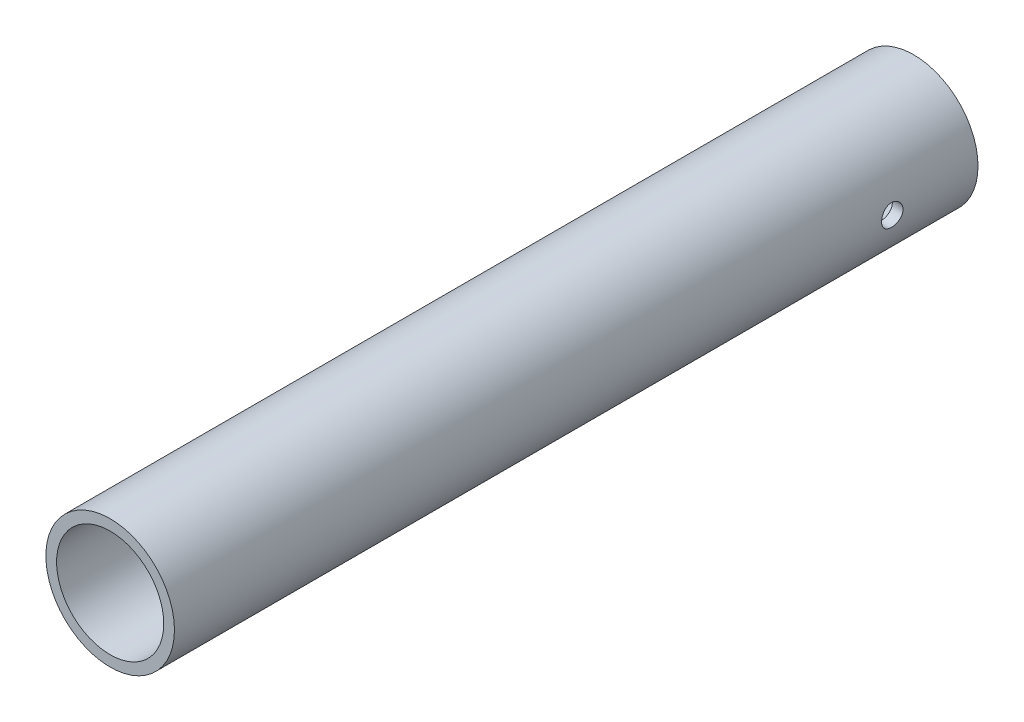
ISO-10303-21;
HEADER;
FILE_DESCRIPTION(('STEP AP214'),'2;1');
FILE_NAME('part.step','',(''),(''),'','','');
FILE_SCHEMA(('AUTOMOTIVE_DESIGN { 1 0 10303 214 1 1 1 1 }'));
ENDSEC;
DATA;
#1=APPLICATION_CONTEXT('core data for automotive mechanical design processes');
#2=APPLICATION_PROTOCOL_DEFINITION('international standard','automotive_design',2000,#1);
#3=PRODUCT_CONTEXT('',#1,'mechanical');
#4=PRODUCT('Part','Part','',(#3));
#5=PRODUCT_RELATED_PRODUCT_CATEGORY('part','',(#4));
#6=PRODUCT_DEFINITION_FORMATION('','',#4);
#7=PRODUCT_DEFINITION_CONTEXT('part definition',#1,'design');
#8=PRODUCT_DEFINITION('design','',#6,#7);
#9=PRODUCT_DEFINITION_SHAPE('','',#8);
#10=(LENGTH_UNIT() NAMED_UNIT(*) SI_UNIT(.MILLI.,.METRE.));
#11=(NAMED_UNIT(*) PLANE_ANGLE_UNIT() SI_UNIT($,.RADIAN.));
#12=(NAMED_UNIT(*) SI_UNIT($,.STERADIAN.) SOLID_ANGLE_UNIT());
#13=UNCERTAINTY_MEASURE_WITH_UNIT(LENGTH_MEASURE(1.E-05),#10,'distance_accuracy_value','');
#14=(GEOMETRIC_REPRESENTATION_CONTEXT(3) GLOBAL_UNCERTAINTY_ASSIGNED_CONTEXT((#13)) GLOBAL_UNIT_ASSIGNED_CONTEXT((#10,
#11,#12)) REPRESENTATION_CONTEXT('',''));
#15=CARTESIAN_POINT('',(0.,0.,0.));
#16=DIRECTION('',(0.,0.,1.));
#17=DIRECTION('',(1.,0.,0.));
#18=AXIS2_PLACEMENT_3D('',#15,#16,#17);
#19=CARTESIAN_POINT('',(0.,0.,75.));
#20=DIRECTION('',(0.,0.,1.));
#21=DIRECTION('',(1.,0.,0.));
#22=AXIS2_PLACEMENT_3D('',#19,#20,#21);
#23=PLANE('',#22);
#24=CARTESIAN_POINT('',(0.,0.,75.));
#25=DIRECTION('',(0.,0.,1.));
#26=DIRECTION('',(1.,0.,0.));
#27=AXIS2_PLACEMENT_3D('',#24,#25,#26);
#28=CIRCLE('',#27,6.);
#29=CARTESIAN_POINT('',(6.,0.,75.));
#30=VERTEX_POINT('',#29);
#31=EDGE_CURVE('E10',#30,#30,#28,.T.);
#32=ORIENTED_EDGE('',*,*,#31,.T.);
#33=EDGE_LOOP('',(#32));
#34=FACE_BOUND('',#33,.T.);
#35=CARTESIAN_POINT('',(0.,0.,75.));
#36=DIRECTION('',(0.,0.,1.));
#37=DIRECTION('',(1.,0.,0.));
#38=AXIS2_PLACEMENT_3D('',#35,#36,#37);
#39=CIRCLE('',#38,5.);
#40=CARTESIAN_POINT('',(5.,0.,75.));
#41=VERTEX_POINT('',#40);
#42=EDGE_CURVE('E49',#41,#41,#39,.T.);
#43=ORIENTED_EDGE('',*,*,#42,.F.);
#44=EDGE_LOOP('',(#43));
#45=FACE_BOUND('',#44,.T.);
#46=ADVANCED_FACE('F30',(#34,#45),#23,.T.);
#47=CARTESIAN_POINT('',(0.,0.,0.));
#48=DIRECTION('',(0.,0.,1.));
#49=DIRECTION('',(1.,0.,0.));
#50=AXIS2_PLACEMENT_3D('',#47,#48,#49);
#51=PLANE('',#50);
#52=CARTESIAN_POINT('',(0.,0.,0.));
#53=DIRECTION('',(0.,0.,1.));
#54=DIRECTION('',(1.,0.,0.));
#55=AXIS2_PLACEMENT_3D('',#52,#53,#54);
#56=CIRCLE('',#55,6.);
#57=CARTESIAN_POINT('',(6.,0.,0.));
#58=VERTEX_POINT('',#57);
#59=EDGE_CURVE('E44',#58,#58,#56,.T.);
#60=ORIENTED_EDGE('',*,*,#59,.F.);
#61=EDGE_LOOP('',(#60));
#62=FACE_BOUND('',#61,.T.);
#63=CARTESIAN_POINT('',(0.,0.,0.));
#64=DIRECTION('',(0.,0.,1.));
#65=DIRECTION('',(1.,0.,0.));
#66=AXIS2_PLACEMENT_3D('',#63,#64,#65);
#67=CIRCLE('',#66,5.);
#68=CARTESIAN_POINT('',(5.,0.,0.));
#69=VERTEX_POINT('',#68);
#70=EDGE_CURVE('E52',#69,#69,#67,.T.);
#71=ORIENTED_EDGE('',*,*,#70,.T.);
#72=EDGE_LOOP('',(#71));
#73=FACE_BOUND('',#72,.T.);
#74=ADVANCED_FACE('F88',(#62,#73),#51,.F.);
#75=CARTESIAN_POINT('',(0.,0.,75.));
#76=DIRECTION('',(0.,0.,-1.));
#77=DIRECTION('',(-1.,0.,0.));
#78=AXIS2_PLACEMENT_3D('',#75,#76,#77);
#79=CYLINDRICAL_SURFACE('',#78,6.);
#80=CARTESIAN_POINT('',(-6.,0.,7.));
#81=CARTESIAN_POINT('',(-5.9999990446753,0.0557563619832858,7.00000223557913));
#82=CARTESIAN_POINT('',(-5.99921471165214,0.111543152735528,7.00467890998757));
#83=CARTESIAN_POINT('',(-5.99616137976555,0.221552088669217,7.02325426350613));
#84=CARTESIAN_POINT('',(-5.99389101569556,0.275772747183698,7.03716142276464));
#85=CARTESIAN_POINT('',(-5.9881202729458,0.381041898885057,7.0737661794371));
#86=CARTESIAN_POINT('',(-5.98462090063677,0.43209294737276,7.09645658625623));
#87=CARTESIAN_POINT('',(-5.97677690832828,0.529656736791177,7.14996491682096));
#88=CARTESIAN_POINT('',(-5.97243238501774,0.576169995951435,7.1807819109932));
#89=CARTESIAN_POINT('',(-5.96333326983325,0.663789045716671,7.24998203352818));
#90=CARTESIAN_POINT('',(-5.95857548725943,0.704845161413986,7.28842764585445));
#91=CARTESIAN_POINT('',(-5.94921050750693,0.77995539946397,7.37165918738913));
#92=CARTESIAN_POINT('',(-5.94460331985067,0.814009079756388,7.41644551658265));
#93=CARTESIAN_POINT('',(-5.93603026303912,0.874346850242052,7.51142838647882));
#94=CARTESIAN_POINT('',(-5.93206851636655,0.900581821144399,7.5616565347219));
#95=CARTESIAN_POINT('',(-5.9252791591787,0.944223346164486,7.66588382572025));
#96=CARTESIAN_POINT('',(-5.92245147205723,0.961630496626244,7.71988271347105));
#97=CARTESIAN_POINT('',(-5.91828214737102,0.986965751113922,7.82959210994262));
#98=CARTESIAN_POINT('',(-5.9169270739428,0.994979611654159,7.88528229460056));
#99=CARTESIAN_POINT('',(-5.9158157557466,1.00156669011595,7.99723211075339));
#100=CARTESIAN_POINT('',(-5.91605939782886,1.0001405761556,8.05349170166692));
#101=CARTESIAN_POINT('',(-5.91810571545422,0.987958039358459,8.16437114451018));
#102=CARTESIAN_POINT('',(-5.91989229327567,0.977297952755908,8.21900192141809));
#103=CARTESIAN_POINT('',(-5.92479798084403,0.947101256161377,8.32568852713165));
#104=CARTESIAN_POINT('',(-5.92791713629309,0.927564341727895,8.37774426755542));
#105=CARTESIAN_POINT('',(-5.9351539173364,0.880070898437564,8.47809152937637));
#106=CARTESIAN_POINT('',(-5.9392762684293,0.852074365551885,8.52636376243249));
#107=CARTESIAN_POINT('',(-5.94805167366004,0.788484807022972,8.61756176021535));
#108=CARTESIAN_POINT('',(-5.95270477061715,0.752891168261714,8.66048709298197));
#109=CARTESIAN_POINT('',(-5.96208811151914,0.67459288486362,8.74033043432294));
#110=CARTESIAN_POINT('',(-5.96681859692661,0.63180558554925,8.77716740741603));
#111=CARTESIAN_POINT('',(-5.97577040558689,0.540614099592658,8.84315110506613));
#112=CARTESIAN_POINT('',(-5.97999172555898,0.492209876762568,8.87229778007329));
#113=CARTESIAN_POINT('',(-5.98745557157165,0.391082366466684,8.92208089085451));
#114=CARTESIAN_POINT('',(-5.99069727362979,0.338355490225864,8.9427101677325));
#115=CARTESIAN_POINT('',(-5.99583001205064,0.230119338241092,8.97479768609839));
#116=CARTESIAN_POINT('',(-5.9977211614019,0.174610295671787,8.98625669478949));
#117=CARTESIAN_POINT('',(-5.99992451937074,0.0630839605206491,8.99956854338445));
#118=CARTESIAN_POINT('',(-6.00025501205114,0.00708029486040419,9.00153262872224));
#119=CARTESIAN_POINT('',(-5.99934989768468,-0.104455909155955,8.99609546222875));
#120=CARTESIAN_POINT('',(-5.99811435089647,-0.159988465556816,8.9886945707465));
#121=CARTESIAN_POINT('',(-5.99422730775281,-0.268662470218706,8.96483006026581));
#122=CARTESIAN_POINT('',(-5.99158441920524,-0.321816347354152,8.94842151664395));
#123=CARTESIAN_POINT('',(-5.98517785782144,-0.424618753944177,8.90706619272019));
#124=CARTESIAN_POINT('',(-5.98141412204808,-0.474267086363887,8.88211893294589));
#125=CARTESIAN_POINT('',(-5.97313806520963,-0.569132275787583,8.82413955012128));
#126=CARTESIAN_POINT('',(-5.96861942354809,-0.614306100374859,8.7910379375331));
#127=CARTESIAN_POINT('',(-5.9593538695676,-0.698497434201075,8.71778507384598));
#128=CARTESIAN_POINT('',(-5.95460694068619,-0.737514495878632,8.67763331068933));
#129=CARTESIAN_POINT('',(-5.94536070094338,-0.808697111863199,8.59092098077143));
#130=CARTESIAN_POINT('',(-5.94086446454842,-0.840787504445485,8.54429833379424));
#131=CARTESIAN_POINT('',(-5.93268611911154,-0.896680924117993,8.44625881234458));
#132=CARTESIAN_POINT('',(-5.92900398426408,-0.920484213907928,8.394842089909));
#133=CARTESIAN_POINT('',(-5.92289381479082,-0.959015332589259,8.28888410687515));
#134=CARTESIAN_POINT('',(-5.92046061724426,-0.973780573019177,8.2343567619878));
#135=CARTESIAN_POINT('',(-5.91711086734104,-0.99393418151131,8.1235519483113));
#136=CARTESIAN_POINT('',(-5.91619418313089,-0.999323364778466,8.06727463210718));
#137=CARTESIAN_POINT('',(-5.91598693233605,-1.00054914641894,7.95531793361504));
#138=CARTESIAN_POINT('',(-5.9166762260226,-0.996504054450073,7.89963984856989));
#139=CARTESIAN_POINT('',(-5.91955912581491,-0.979231935582738,7.78976830077969));
#140=CARTESIAN_POINT('',(-5.92175272704486,-0.966004938444989,7.73557483322325));
#141=CARTESIAN_POINT('',(-5.92738942512688,-0.930789795837959,7.63025662508295));
#142=CARTESIAN_POINT('',(-5.93083106887868,-0.908811836240175,7.57912839597759));
#143=CARTESIAN_POINT('',(-5.93857747568883,-0.856730801566362,7.48126573232206));
#144=CARTESIAN_POINT('',(-5.9428822815536,-0.826627323499424,7.43453151585115));
#145=CARTESIAN_POINT('',(-5.95193381618249,-0.758727553748861,7.3461857667569));
#146=CARTESIAN_POINT('',(-5.95668518230521,-0.720844225437458,7.30464159331989));
#147=CARTESIAN_POINT('',(-5.96605748944336,-0.63864361255209,7.22845935821003));
#148=CARTESIAN_POINT('',(-5.97067840010619,-0.594324845165053,7.19382289254473));
#149=CARTESIAN_POINT('',(-5.97930611856888,-0.500147667856111,7.13222069272002));
#150=CARTESIAN_POINT('',(-5.98330846501242,-0.450253115013125,7.10530958427482));
#151=CARTESIAN_POINT('',(-5.9902046704071,-0.346605227751591,7.06029220615603));
#152=CARTESIAN_POINT('',(-5.99309963270993,-0.292855797932002,7.04217716756812));
#153=CARTESIAN_POINT('',(-5.99682316333182,-0.199081324018159,7.01919789034933));
#154=CARTESIAN_POINT('',(-5.99800810909344,-0.159623532119378,7.01201021215362));
#155=CARTESIAN_POINT('',(-5.99959686394448,-0.0801157241279229,7.0024105048621));
#156=CARTESIAN_POINT('',(-6.00000068648257,-0.0400657182433973,6.99999839354506));
#157=CARTESIAN_POINT('',(-6.,0.,7.));
#158=B_SPLINE_CURVE_WITH_KNOTS('',3,(#80,#81,#82,#83,#84,#85,#86,#87,#88,#89,#90,#91,#92,#93,
#94,#95,#96,#97,#98,#99,#100,#101,#102,#103,#104,#105,#106,#107,#108,#109,#110,#111,#112,#113,
#114,#115,#116,#117,#118,#119,#120,#121,#122,#123,#124,#125,#126,#127,#128,#129,#130,#131,#132,
#133,#134,#135,#136,#137,#138,#139,#140,#141,#142,#143,#144,#145,#146,#147,#148,#149,#150,#151,
#152,#153,#154,#155,#156,#157),.UNSPECIFIED.,.T.,.F.,(4,2,2,2,2,2,2,2,2,2,2,2,2,2,2,2,2,2,2,2,2,
2,2,2,2,2,2,2,2,2,2,2,2,2,2,2,2,2,4),(0.,0.167122633975403,0.334399018278168,0.501538746810107,
0.668659365069915,0.837209964249328,1.00577120067943,1.17537008329536,1.34495750750472,
1.51298430841369,1.68099921728354,1.84728208704163,2.01357066010152,2.18065822653023,
2.34775928272229,2.5169310796453,2.68610396654339,2.85541875566361,3.02471937808459,
3.19203153396558,3.35933725214343,3.52563122802566,3.69193454330426,3.85970730250809,
4.02749225221713,4.19701528803047,4.36653294950377,4.53534408936708,4.70414055114646,
4.87083163809079,5.03752218475253,5.20401927290488,5.37052462011734,5.53900553677356,
5.70752533551588,5.87720892642879,6.04672300852028,6.16681699265607,6.28690890910786),.UNSPECIFIED.);
#159=CARTESIAN_POINT('',(-6.,0.,7.));
#160=VERTEX_POINT('',#159);
#161=EDGE_CURVE('E77',#160,#160,#158,.T.);
#162=ORIENTED_EDGE('',*,*,#161,.T.);
#163=EDGE_LOOP('',(#162));
#164=FACE_BOUND('',#163,.T.);
#165=CARTESIAN_POINT('',(6.,0.,7.));
#166=CARTESIAN_POINT('',(5.99999904467529,-0.0557563619832859,7.00000223557913));
#167=CARTESIAN_POINT('',(5.99921471165214,-0.111543152735528,7.00467890998757));
#168=CARTESIAN_POINT('',(5.99616137976555,-0.221552088669217,7.02325426350613));
#169=CARTESIAN_POINT('',(5.99389101569556,-0.275772747183699,7.03716142276464));
#170=CARTESIAN_POINT('',(5.9881202729458,-0.381041898885057,7.0737661794371));
#171=CARTESIAN_POINT('',(5.98462090063677,-0.43209294737276,7.09645658625623));
#172=CARTESIAN_POINT('',(5.97677690832828,-0.529656736791178,7.14996491682096));
#173=CARTESIAN_POINT('',(5.97243238501774,-0.576169995951436,7.1807819109932));
#174=CARTESIAN_POINT('',(5.96333326983325,-0.663789045716672,7.24998203352818));
#175=CARTESIAN_POINT('',(5.95857548725943,-0.704845161413986,7.28842764585445));
#176=CARTESIAN_POINT('',(5.94921050750693,-0.77995539946397,7.37165918738913));
#177=CARTESIAN_POINT('',(5.94460331985067,-0.814009079756388,7.41644551658265));
#178=CARTESIAN_POINT('',(5.93603026303912,-0.874346850242052,7.51142838647882));
#179=CARTESIAN_POINT('',(5.93206851636655,-0.900581821144399,7.5616565347219));
#180=CARTESIAN_POINT('',(5.9252791591787,-0.944223346164486,7.66588382572025));
#181=CARTESIAN_POINT('',(5.92245147205723,-0.961630496626244,7.71988271347105));
#182=CARTESIAN_POINT('',(5.91828214737102,-0.986965751113922,7.82959210994262));
#183=CARTESIAN_POINT('',(5.9169270739428,-0.994979611654159,7.88528229460056));
#184=CARTESIAN_POINT('',(5.9158157557466,-1.00156669011595,7.99723211075339));
#185=CARTESIAN_POINT('',(5.91605939782886,-1.0001405761556,8.05349170166692));
#186=CARTESIAN_POINT('',(5.91810571545422,-0.987958039358459,8.16437114451018));
#187=CARTESIAN_POINT('',(5.91989229327567,-0.977297952755908,8.21900192141809));
#188=CARTESIAN_POINT('',(5.92479798084403,-0.947101256161377,8.32568852713165));
#189=CARTESIAN_POINT('',(5.92791713629309,-0.927564341727895,8.37774426755542));
#190=CARTESIAN_POINT('',(5.9351539173364,-0.880070898437564,8.47809152937637));
#191=CARTESIAN_POINT('',(5.9392762684293,-0.852074365551885,8.52636376243249));
#192=CARTESIAN_POINT('',(5.94805167366004,-0.788484807022972,8.61756176021535));
#193=CARTESIAN_POINT('',(5.95270477061714,-0.752891168261713,8.66048709298197));
#194=CARTESIAN_POINT('',(5.96208811151914,-0.67459288486362,8.74033043432294));
#195=CARTESIAN_POINT('',(5.96681859692661,-0.63180558554925,8.77716740741603));
#196=CARTESIAN_POINT('',(5.97577040558689,-0.540614099592658,8.84315110506613));
#197=CARTESIAN_POINT('',(5.97999172555898,-0.492209876762568,8.87229778007329));
#198=CARTESIAN_POINT('',(5.98745557157165,-0.391082366466684,8.92208089085451));
#199=CARTESIAN_POINT('',(5.99069727362979,-0.338355490225864,8.9427101677325));
#200=CARTESIAN_POINT('',(5.99583001205064,-0.230119338241092,8.97479768609839));
#201=CARTESIAN_POINT('',(5.9977211614019,-0.174610295671787,8.98625669478949));
#202=CARTESIAN_POINT('',(5.99992451937074,-0.0630839605206489,8.99956854338445));
#203=CARTESIAN_POINT('',(6.00025501205114,-0.00708029486040385,9.00153262872224));
#204=CARTESIAN_POINT('',(5.99934989768468,0.104455909155956,8.99609546222875));
#205=CARTESIAN_POINT('',(5.99811435089647,0.159988465556816,8.9886945707465));
#206=CARTESIAN_POINT('',(5.99422730775281,0.268662470218706,8.96483006026581));
#207=CARTESIAN_POINT('',(5.99158441920524,0.321816347354152,8.94842151664395));
#208=CARTESIAN_POINT('',(5.98517785782144,0.424618753944177,8.90706619272019));
#209=CARTESIAN_POINT('',(5.98141412204808,0.474267086363888,8.88211893294589));
#210=CARTESIAN_POINT('',(5.97313806520963,0.569132275787583,8.82413955012128));
#211=CARTESIAN_POINT('',(5.96861942354809,0.614306100374859,8.7910379375331));
#212=CARTESIAN_POINT('',(5.9593538695676,0.698497434201075,8.71778507384598));
#213=CARTESIAN_POINT('',(5.95460694068619,0.737514495878633,8.67763331068933));
#214=CARTESIAN_POINT('',(5.94536070094338,0.8086971118632,8.59092098077143));
#215=CARTESIAN_POINT('',(5.94086446454842,0.840787504445485,8.54429833379424));
#216=CARTESIAN_POINT('',(5.93268611911154,0.896680924117993,8.44625881234458));
#217=CARTESIAN_POINT('',(5.92900398426408,0.920484213907928,8.394842089909));
#218=CARTESIAN_POINT('',(5.92289381479082,0.959015332589259,8.28888410687515));
#219=CARTESIAN_POINT('',(5.92046061724426,0.973780573019177,8.2343567619878));
#220=CARTESIAN_POINT('',(5.91711086734104,0.99393418151131,8.1235519483113));
#221=CARTESIAN_POINT('',(5.91619418313089,0.999323364778466,8.06727463210718));
#222=CARTESIAN_POINT('',(5.91598693233605,1.00054914641894,7.95531793361504));
#223=CARTESIAN_POINT('',(5.9166762260226,0.996504054450073,7.89963984856989));
#224=CARTESIAN_POINT('',(5.91955912581491,0.979231935582738,7.78976830077969));
#225=CARTESIAN_POINT('',(5.92175272704486,0.966004938444989,7.73557483322325));
#226=CARTESIAN_POINT('',(5.92738942512688,0.930789795837959,7.63025662508295));
#227=CARTESIAN_POINT('',(5.93083106887868,0.908811836240175,7.57912839597759));
#228=CARTESIAN_POINT('',(5.93857747568883,0.856730801566362,7.48126573232206));
#229=CARTESIAN_POINT('',(5.9428822815536,0.826627323499424,7.43453151585115));
#230=CARTESIAN_POINT('',(5.95193381618249,0.758727553748861,7.3461857667569));
#231=CARTESIAN_POINT('',(5.95668518230521,0.720844225437458,7.30464159331989));
#232=CARTESIAN_POINT('',(5.96605748944336,0.638643612552091,7.22845935821003));
#233=CARTESIAN_POINT('',(5.97067840010619,0.594324845165054,7.19382289254473));
#234=CARTESIAN_POINT('',(5.97930611856888,0.500147667856111,7.13222069272002));
#235=CARTESIAN_POINT('',(5.98330846501242,0.450253115013126,7.10530958427482));
#236=CARTESIAN_POINT('',(5.9902046704071,0.346605227751591,7.06029220615603));
#237=CARTESIAN_POINT('',(5.99309963270993,0.292855797932003,7.04217716756812));
#238=CARTESIAN_POINT('',(5.99682316333182,0.199081324018159,7.01919789034933));
#239=CARTESIAN_POINT('',(5.99800810909344,0.159623532119378,7.01201021215362));
#240=CARTESIAN_POINT('',(5.99959686394448,0.0801157241279233,7.0024105048621));
#241=CARTESIAN_POINT('',(6.00000068648256,0.0400657182433975,6.99999839354506));
#242=CARTESIAN_POINT('',(6.,0.,7.));
#243=B_SPLINE_CURVE_WITH_KNOTS('',3,(#165,#166,#167,#168,#169,#170,#171,#172,#173,#174,#175,
#176,#177,#178,#179,#180,#181,#182,#183,#184,#185,#186,#187,#188,#189,#190,#191,#192,#193,#194,
#195,#196,#197,#198,#199,#200,#201,#202,#203,#204,#205,#206,#207,#208,#209,#210,#211,#212,#213,
#214,#215,#216,#217,#218,#219,#220,#221,#222,#223,#224,#225,#226,#227,#228,#229,#230,#231,#232,
#233,#234,#235,#236,#237,#238,#239,#240,#241,#242),.UNSPECIFIED.,.T.,.F.,(4,2,2,2,2,2,2,2,2,2,2,
2,2,2,2,2,2,2,2,2,2,2,2,2,2,2,2,2,2,2,2,2,2,2,2,2,2,2,4),(0.,0.167122633975404,
0.334399018278168,0.501538746810108,0.668659365069916,0.837209964249328,1.00577120067943,
1.17537008329536,1.34495750750472,1.51298430841369,1.68099921728354,1.84728208704163,
2.01357066010152,2.18065822653023,2.34775928272229,2.5169310796453,2.68610396654339,
2.85541875566361,3.02471937808459,3.19203153396559,3.35933725214344,3.52563122802566,
3.69193454330426,3.85970730250809,4.02749225221713,4.19701528803047,4.36653294950377,
4.53534408936708,4.70414055114646,4.87083163809079,5.03752218475253,5.20401927290488,
5.37052462011734,5.53900553677356,5.70752533551588,5.87720892642879,6.04672300852028,
6.16681699265607,6.28690890910786),.UNSPECIFIED.);
#244=CARTESIAN_POINT('',(6.,0.,7.));
#245=VERTEX_POINT('',#244);
#246=EDGE_CURVE('E72',#245,#245,#243,.T.);
#247=ORIENTED_EDGE('',*,*,#246,.T.);
#248=EDGE_LOOP('',(#247));
#249=FACE_BOUND('',#248,.T.);
#250=ORIENTED_EDGE('',*,*,#31,.F.);
#251=EDGE_LOOP('',(#250));
#252=FACE_BOUND('',#251,.T.);
#253=ORIENTED_EDGE('',*,*,#59,.T.);
#254=EDGE_LOOP('',(#253));
#255=FACE_BOUND('',#254,.T.);
#256=ADVANCED_FACE('F32',(#164,#249,#252,#255),#79,.T.);
#257=CARTESIAN_POINT('',(0.,0.,75.));
#258=DIRECTION('',(0.,0.,-1.));
#259=DIRECTION('',(-1.,0.,0.));
#260=AXIS2_PLACEMENT_3D('',#257,#258,#259);
#261=CYLINDRICAL_SURFACE('',#260,5.);
#262=CARTESIAN_POINT('',(-5.,0.,8.99999999999998));
#263=CARTESIAN_POINT('',(-4.99999897580871,-0.0555769067926341,8.99999795550163));
#264=CARTESIAN_POINT('',(-4.99906385178231,-0.111179660201524,8.99535115703235));
#265=CARTESIAN_POINT('',(-4.99542365623231,-0.220813507689021,8.97690149988476));
#266=CARTESIAN_POINT('',(-4.99271717860186,-0.274843317541356,8.96309136719849));
#267=CARTESIAN_POINT('',(-4.98583649278287,-0.379730305263312,8.92675872637921));
#268=CARTESIAN_POINT('',(-4.98166369076718,-0.430590467933133,8.90424456315531));
#269=CARTESIAN_POINT('',(-4.97230398035314,-0.527807988864224,8.85116775248871));
#270=CARTESIAN_POINT('',(-4.96711713235707,-0.57416561507581,8.82060558439279));
#271=CARTESIAN_POINT('',(-4.9562216532997,-0.661693477314864,8.75186150570856));
#272=CARTESIAN_POINT('',(-4.95050745504347,-0.702793951158523,8.7135916446088));
#273=CARTESIAN_POINT('',(-4.93924180452588,-0.778036756608027,8.6307075836083));
#274=CARTESIAN_POINT('',(-4.93369036500424,-0.812178544770423,8.58609288866488));
#275=CARTESIAN_POINT('',(-4.92332441812615,-0.872831753347619,8.49128380698813));
#276=CARTESIAN_POINT('',(-4.91851707364946,-0.899270938865865,8.44104235620364));
#277=CARTESIAN_POINT('',(-4.91026268058418,-0.943305666580307,8.33671818099592));
#278=CARTESIAN_POINT('',(-4.90681549761962,-0.960902082437236,8.28263583665365));
#279=CARTESIAN_POINT('',(-4.90172805252204,-0.986525299884826,8.17291563609208));
#280=CARTESIAN_POINT('',(-4.90006470107188,-0.994674497958776,8.11730745585777));
#281=CARTESIAN_POINT('',(-4.89866375060627,-1.00155212772612,8.00549017863566));
#282=CARTESIAN_POINT('',(-4.89892595467841,-1.0002815227135,7.94928114367985));
#283=CARTESIAN_POINT('',(-4.90132551148185,-0.988454573101817,7.838753211979));
#284=CARTESIAN_POINT('',(-4.90343452858764,-0.978038540243904,7.78441859437269));
#285=CARTESIAN_POINT('',(-4.90924546160001,-0.948437884623049,7.678283923337));
#286=CARTESIAN_POINT('',(-4.91294745357779,-0.92925284310068,7.62648399108099));
#287=CARTESIAN_POINT('',(-4.92155618500408,-0.882524783674719,7.5264847382964));
#288=CARTESIAN_POINT('',(-4.92647089813704,-0.854926151232113,7.47831212043083));
#289=CARTESIAN_POINT('',(-4.93694618773062,-0.792193574572678,7.38722915002719));
#290=CARTESIAN_POINT('',(-4.94250683838366,-0.757058764356828,7.34431940314884));
#291=CARTESIAN_POINT('',(-4.95377021241462,-0.679499934560583,7.26417059754306));
#292=CARTESIAN_POINT('',(-4.95947369210905,-0.636956161212444,7.22704743214087));
#293=CARTESIAN_POINT('',(-4.97028848714408,-0.546185024062009,7.16044615369878));
#294=CARTESIAN_POINT('',(-4.97539979488974,-0.497957587379389,7.13096813870642));
#295=CARTESIAN_POINT('',(-4.98446690160887,-0.39705938687892,7.08047249077403));
#296=CARTESIAN_POINT('',(-4.98842088848272,-0.3443818195853,7.05946810635546));
#297=CARTESIAN_POINT('',(-4.99471408987858,-0.236148976448665,7.02663952596143));
#298=CARTESIAN_POINT('',(-4.99705350000531,-0.180594050072449,7.01481421792637));
#299=CARTESIAN_POINT('',(-4.99982671866868,-0.0691794056271502,7.00084354620572));
#300=CARTESIAN_POINT('',(-5.0002917465247,-0.013340328325576,6.99853958045973));
#301=CARTESIAN_POINT('',(-4.99935051930103,0.0979249341927141,7.00324985894218));
#302=CARTESIAN_POINT('',(-4.99794436941446,0.153351142443793,7.0102635793526));
#303=CARTESIAN_POINT('',(-4.99343832008018,0.26170565994654,7.03327837354396));
#304=CARTESIAN_POINT('',(-4.99035376404206,0.314651948339903,7.0491980684979));
#305=CARTESIAN_POINT('',(-4.98283552061033,0.417123627499667,7.08948398265581));
#306=CARTESIAN_POINT('',(-4.97840173214227,0.466648761637539,7.11385083467683));
#307=CARTESIAN_POINT('',(-4.96859911533294,0.561541173686217,7.17068249065131));
#308=CARTESIAN_POINT('',(-4.96321950437052,0.606850126752187,7.20324278103895));
#309=CARTESIAN_POINT('',(-4.95214734829882,0.691418019119205,7.27540919120728));
#310=CARTESIAN_POINT('',(-4.94645476968388,0.730676308930761,7.31501606639987));
#311=CARTESIAN_POINT('',(-4.93529303556965,0.802640590774175,7.40087335189112));
#312=CARTESIAN_POINT('',(-4.92982860233304,0.835237702448654,7.44721574422134));
#313=CARTESIAN_POINT('',(-4.91984191796194,0.892185420051205,7.54481136135668));
#314=CARTESIAN_POINT('',(-4.91531962913343,0.916536355922901,7.59606438957355));
#315=CARTESIAN_POINT('',(-4.90776740584383,0.956151841581959,7.70176824614955));
#316=CARTESIAN_POINT('',(-4.90472974872187,0.97146349979105,7.75620084121032));
#317=CARTESIAN_POINT('',(-4.90047436792025,0.992708651627195,7.86693345349091));
#318=CARTESIAN_POINT('',(-4.89925640691111,0.998643368225111,7.92323322620935));
#319=CARTESIAN_POINT('',(-4.89879149631379,1.00092091086747,8.03500886454432));
#320=CARTESIAN_POINT('',(-4.89950919189301,0.997435788070895,8.09048114892701));
#321=CARTESIAN_POINT('',(-4.90275573484614,0.98135230410006,8.20003164990502));
#322=CARTESIAN_POINT('',(-4.90528456767169,0.968754016129297,8.2541098776948));
#323=CARTESIAN_POINT('',(-4.91185264219159,0.934878568498953,8.35922771124055));
#324=CARTESIAN_POINT('',(-4.91588821018831,0.913622506717344,8.41027436050242));
#325=CARTESIAN_POINT('',(-4.9250171497417,0.863054644601603,8.50810372073444));
#326=CARTESIAN_POINT('',(-4.93011060998894,0.833742168774881,8.55488607372514));
#327=CARTESIAN_POINT('',(-4.94088960523225,0.767305914786413,8.64371557215031));
#328=CARTESIAN_POINT('',(-4.94658372909699,0.73005788723518,8.68566876526759));
#329=CARTESIAN_POINT('',(-4.95786081871955,0.64906436901314,8.76278620552917));
#330=CARTESIAN_POINT('',(-4.96344375863184,0.605317387153334,8.79794889031727));
#331=CARTESIAN_POINT('',(-4.97393832387971,0.512017629088244,8.86083464394645));
#332=CARTESIAN_POINT('',(-4.97884231219246,0.462408884429832,8.88847600328002));
#333=CARTESIAN_POINT('',(-4.98735125085,0.359166360940731,8.93498612259659));
#334=CARTESIAN_POINT('',(-4.99095737138616,0.305536260863125,8.95386278953249));
#335=CARTESIAN_POINT('',(-4.99576372595371,0.20982148892378,8.97865194804472));
#336=CARTESIAN_POINT('',(-4.99734303158452,0.168281664013786,8.98664319370776));
#337=CARTESIAN_POINT('',(-4.99946154139893,0.0844995252100686,8.99731791235836));
#338=CARTESIAN_POINT('',(-5.00000077873155,0.0422572337486198,9.00000155450975));
#339=CARTESIAN_POINT('',(-5.,0.,8.99999999999998));
#340=B_SPLINE_CURVE_WITH_KNOTS('',3,(#262,#263,#264,#265,#266,#267,#268,#269,#270,#271,#272,
#273,#274,#275,#276,#277,#278,#279,#280,#281,#282,#283,#284,#285,#286,#287,#288,#289,#290,#291,
#292,#293,#294,#295,#296,#297,#298,#299,#300,#301,#302,#303,#304,#305,#306,#307,#308,#309,#310,
#311,#312,#313,#314,#315,#316,#317,#318,#319,#320,#321,#322,#323,#324,#325,#326,#327,#328,#329,
#330,#331,#332,#333,#334,#335,#336,#337,#338,#339),.UNSPECIFIED.,.T.,.F.,(4,2,2,2,2,2,2,2,2,2,2,
2,2,2,2,2,2,2,2,2,2,2,2,2,2,2,2,2,2,2,2,2,2,2,2,2,2,2,4),(0.,0.166576130661259,
0.333284650691321,0.499833735250337,0.666372902230861,0.834932670112184,1.00350559674736,
1.17361195005922,1.34370149365197,1.51156185103587,1.67940504281225,1.84471727006278,
2.01003739253729,2.17647490203592,2.3429315474967,2.5123825249135,2.6818356753982,
2.85155274854023,3.02124925698035,3.18810735676265,3.35495607657867,3.52030453950723,
3.68566539216022,3.85305066033358,4.02045388345929,4.19040628579225,4.36035188723466,
4.52940381032722,4.69843368330414,4.864397225677,5.03035943492608,5.19591961253109,
5.36149367581866,5.52988076239142,5.6983065453293,5.86849496675636,6.03852955517518,
6.16518775289893,6.29184191370995),.UNSPECIFIED.);
#341=CARTESIAN_POINT('',(-5.,0.,8.99999999999998));
#342=VERTEX_POINT('',#341);
#343=EDGE_CURVE('E35',#342,#342,#340,.T.);
#344=ORIENTED_EDGE('',*,*,#343,.F.);
#345=EDGE_LOOP('',(#344));
#346=FACE_BOUND('',#345,.T.);
#347=CARTESIAN_POINT('',(5.,0.,7.));
#348=CARTESIAN_POINT('',(4.99999897580871,-0.0555769067926331,7.00000204449835));
#349=CARTESIAN_POINT('',(4.99906385178231,-0.111179660201522,7.00464884296765));
#350=CARTESIAN_POINT('',(4.99542365623231,-0.220813507689019,7.02309850011525));
#351=CARTESIAN_POINT('',(4.99271717860186,-0.274843317541355,7.03690863280151));
#352=CARTESIAN_POINT('',(4.98583649278287,-0.379730305263313,7.07324127362079));
#353=CARTESIAN_POINT('',(4.98166369076718,-0.430590467933134,7.09575543684469));
#354=CARTESIAN_POINT('',(4.97230398035314,-0.527807988864225,7.1488322475113));
#355=CARTESIAN_POINT('',(4.96711713235707,-0.574165615075811,7.17939441560721));
#356=CARTESIAN_POINT('',(4.9562216532997,-0.661693477314864,7.24813849429144));
#357=CARTESIAN_POINT('',(4.95050745504347,-0.702793951158524,7.2864083553912));
#358=CARTESIAN_POINT('',(4.93924180452588,-0.778036756608027,7.3692924163917));
#359=CARTESIAN_POINT('',(4.93369036500424,-0.812178544770424,7.41390711133512));
#360=CARTESIAN_POINT('',(4.92332441812615,-0.872831753347619,7.50871619301188));
#361=CARTESIAN_POINT('',(4.91851707364946,-0.899270938865866,7.55895764379636));
#362=CARTESIAN_POINT('',(4.91026268058418,-0.943305666580307,7.66328181900408));
#363=CARTESIAN_POINT('',(4.90681549761962,-0.960902082437237,7.71736416334635));
#364=CARTESIAN_POINT('',(4.90172805252205,-0.986525299884826,7.82708436390792));
#365=CARTESIAN_POINT('',(4.90006470107188,-0.994674497958776,7.88269254414223));
#366=CARTESIAN_POINT('',(4.89866375060627,-1.00155212772612,7.99450982136434));
#367=CARTESIAN_POINT('',(4.89892595467841,-1.0002815227135,8.05071885632015));
#368=CARTESIAN_POINT('',(4.90132551148185,-0.988454573101817,8.16124678802101));
#369=CARTESIAN_POINT('',(4.90343452858764,-0.978038540243904,8.21558140562732));
#370=CARTESIAN_POINT('',(4.90924546160001,-0.948437884623049,8.321716076663));
#371=CARTESIAN_POINT('',(4.91294745357779,-0.929252843100679,8.37351600891901));
#372=CARTESIAN_POINT('',(4.92155618500408,-0.882524783674718,8.4735152617036));
#373=CARTESIAN_POINT('',(4.92647089813704,-0.854926151232113,8.52168787956917));
#374=CARTESIAN_POINT('',(4.93694618773062,-0.792193574572678,8.61277084997281));
#375=CARTESIAN_POINT('',(4.94250683838366,-0.757058764356828,8.65568059685116));
#376=CARTESIAN_POINT('',(4.95377021241462,-0.679499934560583,8.73582940245694));
#377=CARTESIAN_POINT('',(4.95947369210905,-0.636956161212444,8.77295256785913));
#378=CARTESIAN_POINT('',(4.97028848714408,-0.54618502406201,8.83955384630122));
#379=CARTESIAN_POINT('',(4.97539979488974,-0.497957587379389,8.86903186129358));
#380=CARTESIAN_POINT('',(4.98446690160887,-0.397059386878921,8.91952750922597));
#381=CARTESIAN_POINT('',(4.98842088848272,-0.3443818195853,8.94053189364453));
#382=CARTESIAN_POINT('',(4.99471408987858,-0.236148976448665,8.97336047403856));
#383=CARTESIAN_POINT('',(4.99705350000531,-0.18059405007245,8.98518578207363));
#384=CARTESIAN_POINT('',(4.99982671866868,-0.0691794056271511,8.99915645379428));
#385=CARTESIAN_POINT('',(5.0002917465247,-0.0133403283255768,9.00146041954027));
#386=CARTESIAN_POINT('',(4.99935051930103,0.0979249341927136,8.99675014105782));
#387=CARTESIAN_POINT('',(4.99794436941446,0.153351142443793,8.9897364206474));
#388=CARTESIAN_POINT('',(4.99343832008018,0.261705659946541,8.96672162645604));
#389=CARTESIAN_POINT('',(4.99035376404206,0.314651948339903,8.9508019315021));
#390=CARTESIAN_POINT('',(4.98283552061033,0.417123627499667,8.91051601734419));
#391=CARTESIAN_POINT('',(4.97840173214227,0.466648761637539,8.88614916532317));
#392=CARTESIAN_POINT('',(4.96859911533294,0.561541173686217,8.82931750934869));
#393=CARTESIAN_POINT('',(4.96321950437052,0.606850126752188,8.79675721896106));
#394=CARTESIAN_POINT('',(4.95214734829882,0.691418019119206,8.72459080879272));
#395=CARTESIAN_POINT('',(4.94645476968388,0.730676308930762,8.68498393360013));
#396=CARTESIAN_POINT('',(4.93529303556965,0.802640590774175,8.59912664810888));
#397=CARTESIAN_POINT('',(4.92982860233304,0.835237702448655,8.55278425577866));
#398=CARTESIAN_POINT('',(4.91984191796194,0.892185420051205,8.45518863864332));
#399=CARTESIAN_POINT('',(4.91531962913343,0.916536355922901,8.40393561042645));
#400=CARTESIAN_POINT('',(4.90776740584383,0.956151841581958,8.29823175385045));
#401=CARTESIAN_POINT('',(4.90472974872187,0.971463499791049,8.24379915878968));
#402=CARTESIAN_POINT('',(4.90047436792025,0.992708651627195,8.1330665465091));
#403=CARTESIAN_POINT('',(4.89925640691111,0.998643368225111,8.07676677379065));
#404=CARTESIAN_POINT('',(4.89879149631379,1.00092091086747,7.96499113545568));
#405=CARTESIAN_POINT('',(4.89950919189301,0.997435788070895,7.90951885107299));
#406=CARTESIAN_POINT('',(4.90275573484614,0.98135230410006,7.79996835009498));
#407=CARTESIAN_POINT('',(4.90528456767169,0.968754016129297,7.7458901223052));
#408=CARTESIAN_POINT('',(4.91185264219159,0.934878568498953,7.64077228875946));
#409=CARTESIAN_POINT('',(4.91588821018831,0.913622506717344,7.58972563949759));
#410=CARTESIAN_POINT('',(4.9250171497417,0.863054644601604,7.49189627926556));
#411=CARTESIAN_POINT('',(4.93011060998894,0.833742168774881,7.44511392627486));
#412=CARTESIAN_POINT('',(4.94088960523225,0.767305914786413,7.35628442784969));
#413=CARTESIAN_POINT('',(4.94658372909699,0.730057887235179,7.31433123473241));
#414=CARTESIAN_POINT('',(4.95786081871955,0.649064369013139,7.23721379447083));
#415=CARTESIAN_POINT('',(4.96344375863184,0.605317387153334,7.20205110968273));
#416=CARTESIAN_POINT('',(4.97393832387971,0.512017629088246,7.13916535605355));
#417=CARTESIAN_POINT('',(4.97884231219246,0.462408884429835,7.11152399671998));
#418=CARTESIAN_POINT('',(4.98735125085,0.359166360940733,7.06501387740341));
#419=CARTESIAN_POINT('',(4.99095737138616,0.305536260863126,7.04613721046751));
#420=CARTESIAN_POINT('',(4.99576372595371,0.209821488923779,7.02134805195529));
#421=CARTESIAN_POINT('',(4.99734303158452,0.168281664013784,7.01335680629224));
#422=CARTESIAN_POINT('',(4.99946154139893,0.0844995252100669,7.00268208764164));
#423=CARTESIAN_POINT('',(5.00000077873155,0.042257233748619,6.99999844549023));
#424=CARTESIAN_POINT('',(5.,0.,7.));
#425=B_SPLINE_CURVE_WITH_KNOTS('',3,(#347,#348,#349,#350,#351,#352,#353,#354,#355,#356,#357,
#358,#359,#360,#361,#362,#363,#364,#365,#366,#367,#368,#369,#370,#371,#372,#373,#374,#375,#376,
#377,#378,#379,#380,#381,#382,#383,#384,#385,#386,#387,#388,#389,#390,#391,#392,#393,#394,#395,
#396,#397,#398,#399,#400,#401,#402,#403,#404,#405,#406,#407,#408,#409,#410,#411,#412,#413,#414,
#415,#416,#417,#418,#419,#420,#421,#422,#423,#424),.UNSPECIFIED.,.T.,.F.,(4,2,2,2,2,2,2,2,2,2,2,
2,2,2,2,2,2,2,2,2,2,2,2,2,2,2,2,2,2,2,2,2,2,2,2,2,2,2,4),(0.,0.166576130661258,
0.333284650691323,0.499833735250341,0.666372902230863,0.834932670112185,1.00350559674737,
1.17361195005923,1.34370149365197,1.51156185103587,1.67940504281225,1.84471727006278,
2.0100373925373,2.17647490203592,2.3429315474967,2.5123825249135,2.6818356753982,
2.85155274854023,3.02124925698036,3.18810735676265,3.35495607657867,3.52030453950723,
3.68566539216022,3.85305066033358,4.0204538834593,4.19040628579225,4.36035188723466,
4.52940381032722,4.69843368330414,4.86439722567701,5.03035943492608,5.19591961253109,
5.36149367581866,5.52988076239143,5.6983065453293,5.86849496675636,6.03852955517518,
6.16518775289893,6.29184191370995),.UNSPECIFIED.);
#426=CARTESIAN_POINT('',(5.,0.,7.));
#427=VERTEX_POINT('',#426);
#428=EDGE_CURVE('E54',#427,#427,#425,.T.);
#429=ORIENTED_EDGE('',*,*,#428,.F.);
#430=EDGE_LOOP('',(#429));
#431=FACE_BOUND('',#430,.T.);
#432=ORIENTED_EDGE('',*,*,#42,.T.);
#433=EDGE_LOOP('',(#432));
#434=FACE_BOUND('',#433,.T.);
#435=ORIENTED_EDGE('',*,*,#70,.F.);
#436=EDGE_LOOP('',(#435));
#437=FACE_BOUND('',#436,.T.);
#438=ADVANCED_FACE('F59',(#346,#431,#434,#437),#261,.F.);
#439=CARTESIAN_POINT('',(-6.,0.,8.));
#440=DIRECTION('',(1.,0.,0.));
#441=DIRECTION('',(0.,0.,-1.));
#442=AXIS2_PLACEMENT_3D('',#439,#440,#441);
#443=CYLINDRICAL_SURFACE('',#442,0.999999999999999);
#444=ORIENTED_EDGE('',*,*,#428,.T.);
#445=EDGE_LOOP('',(#444));
#446=FACE_BOUND('',#445,.T.);
#447=ORIENTED_EDGE('',*,*,#246,.F.);
#448=EDGE_LOOP('',(#447));
#449=FACE_BOUND('',#448,.T.);
#450=ADVANCED_FACE('F65',(#446,#449),#443,.F.);
#451=ORIENTED_EDGE('',*,*,#343,.T.);
#452=EDGE_LOOP('',(#451));
#453=FACE_BOUND('',#452,.T.);
#454=ORIENTED_EDGE('',*,*,#161,.F.);
#455=EDGE_LOOP('',(#454));
#456=FACE_BOUND('',#455,.T.);
#457=ADVANCED_FACE('F62',(#453,#456),#443,.F.);
#458=CLOSED_SHELL('',(#46,#74,#256,#438,#450,#457));
#459=MANIFOLD_SOLID_BREP('B2',#458);
#460=ADVANCED_BREP_SHAPE_REPRESENTATION('',(#18,#459),#14);
#461=SHAPE_DEFINITION_REPRESENTATION(#9,#460);
ENDSEC;
END-ISO-10303-21;
